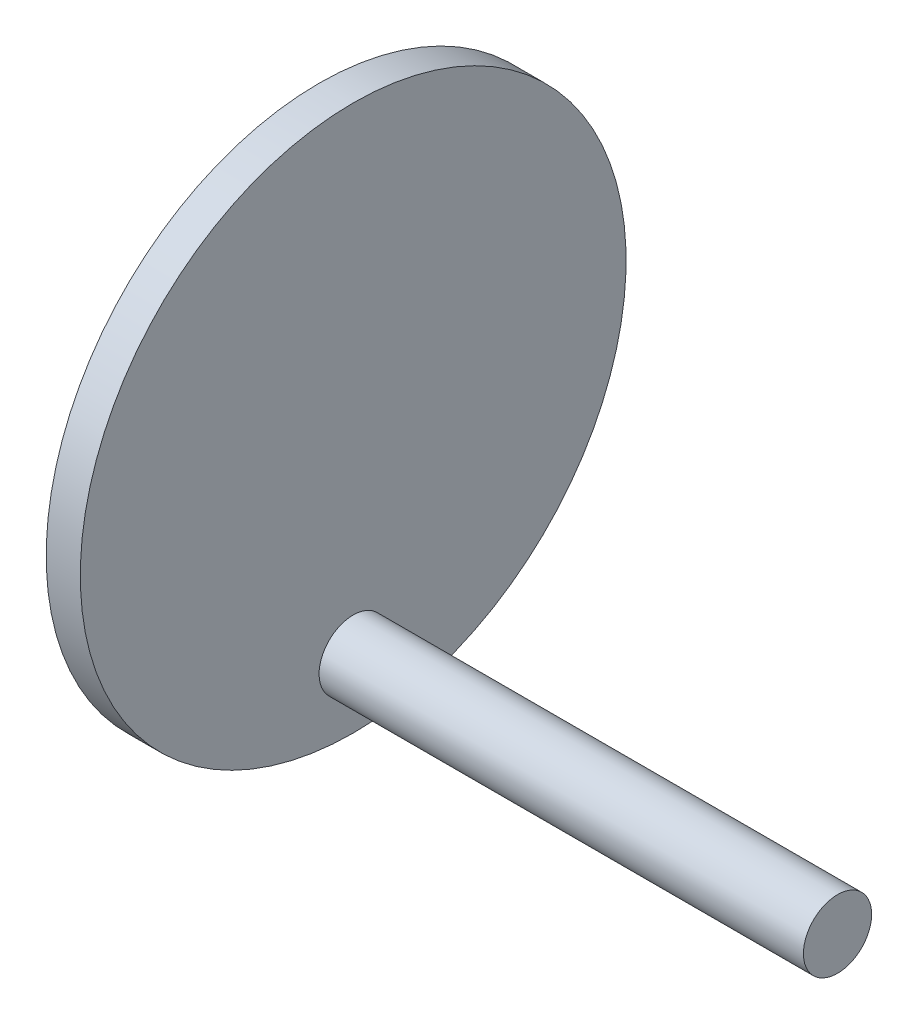
ISO-10303-21;
HEADER;
FILE_DESCRIPTION(('STEP AP214'),'2;1');
FILE_NAME('part.step','',(''),(''),'','','');
FILE_SCHEMA(('AUTOMOTIVE_DESIGN { 1 0 10303 214 1 1 1 1 }'));
ENDSEC;
DATA;
#1=APPLICATION_CONTEXT('core data for automotive mechanical design processes');
#2=APPLICATION_PROTOCOL_DEFINITION('international standard','automotive_design',2000,#1);
#3=PRODUCT_CONTEXT('',#1,'mechanical');
#4=PRODUCT('Part','Part','',(#3));
#5=PRODUCT_RELATED_PRODUCT_CATEGORY('part','',(#4));
#6=PRODUCT_DEFINITION_FORMATION('','',#4);
#7=PRODUCT_DEFINITION_CONTEXT('part definition',#1,'design');
#8=PRODUCT_DEFINITION('design','',#6,#7);
#9=PRODUCT_DEFINITION_SHAPE('','',#8);
#10=(LENGTH_UNIT() NAMED_UNIT(*) SI_UNIT(.MILLI.,.METRE.));
#11=(NAMED_UNIT(*) PLANE_ANGLE_UNIT() SI_UNIT($,.RADIAN.));
#12=(NAMED_UNIT(*) SI_UNIT($,.STERADIAN.) SOLID_ANGLE_UNIT());
#13=UNCERTAINTY_MEASURE_WITH_UNIT(LENGTH_MEASURE(1.E-05),#10,'distance_accuracy_value','');
#14=(GEOMETRIC_REPRESENTATION_CONTEXT(3) GLOBAL_UNCERTAINTY_ASSIGNED_CONTEXT((#13)) GLOBAL_UNIT_ASSIGNED_CONTEXT((#10,
#11,#12)) REPRESENTATION_CONTEXT('',''));
#15=CARTESIAN_POINT('',(0.,0.,0.));
#16=DIRECTION('',(0.,0.,1.));
#17=DIRECTION('',(1.,0.,0.));
#18=AXIS2_PLACEMENT_3D('',#15,#16,#17);
#19=CARTESIAN_POINT('',(-4.99999999999999,60.,0.));
#20=DIRECTION('',(1.,0.,0.));
#21=DIRECTION('',(0.,1.,0.));
#22=AXIS2_PLACEMENT_3D('',#19,#20,#21);
#23=CYLINDRICAL_SURFACE('',#22,7.5);
#24=CARTESIAN_POINT('',(-4.99999999999999,60.,0.));
#25=DIRECTION('',(1.,0.,0.));
#26=DIRECTION('',(0.,1.,0.));
#27=AXIS2_PLACEMENT_3D('',#24,#25,#26);
#28=CIRCLE('',#27,7.5);
#29=CARTESIAN_POINT('',(-4.99999999999999,67.5,0.));
#30=VERTEX_POINT('',#29);
#31=EDGE_CURVE('E10',#30,#30,#28,.T.);
#32=ORIENTED_EDGE('',*,*,#31,.T.);
#33=EDGE_LOOP('',(#32));
#34=FACE_BOUND('',#33,.T.);
#35=CARTESIAN_POINT('',(15.,60.,0.));
#36=DIRECTION('',(1.,0.,0.));
#37=DIRECTION('',(0.,1.,0.));
#38=AXIS2_PLACEMENT_3D('',#35,#36,#37);
#39=CIRCLE('',#38,7.5);
#40=CARTESIAN_POINT('',(15.,67.5,0.));
#41=VERTEX_POINT('',#40);
#42=EDGE_CURVE('E41',#41,#41,#39,.T.);
#43=ORIENTED_EDGE('',*,*,#42,.F.);
#44=EDGE_LOOP('',(#43));
#45=FACE_BOUND('',#44,.T.);
#46=ADVANCED_FACE('F35',(#34,#45),#23,.T.);
#47=CARTESIAN_POINT('',(-4.99999999999999,60.,0.));
#48=DIRECTION('',(1.,0.,0.));
#49=DIRECTION('',(0.,1.,0.));
#50=AXIS2_PLACEMENT_3D('',#47,#48,#49);
#51=PLANE('',#50);
#52=ORIENTED_EDGE('',*,*,#31,.F.);
#53=EDGE_LOOP('',(#52));
#54=FACE_BOUND('',#53,.T.);
#55=ADVANCED_FACE('F79',(#54),#51,.F.);
#56=CARTESIAN_POINT('',(20.,60.,0.));
#57=DIRECTION('',(-1.,0.,0.));
#58=DIRECTION('',(0.,-1.,0.));
#59=AXIS2_PLACEMENT_3D('',#56,#57,#58);
#60=CYLINDRICAL_SURFACE('',#59,40.);
#61=CARTESIAN_POINT('',(20.,60.,0.));
#62=DIRECTION('',(1.,0.,0.));
#63=DIRECTION('',(0.,1.,0.));
#64=AXIS2_PLACEMENT_3D('',#61,#62,#63);
#65=CIRCLE('',#64,40.);
#66=CARTESIAN_POINT('',(20.,100.,0.));
#67=VERTEX_POINT('',#66);
#68=EDGE_CURVE('E45',#67,#67,#65,.T.);
#69=ORIENTED_EDGE('',*,*,#68,.F.);
#70=EDGE_LOOP('',(#69));
#71=FACE_BOUND('',#70,.T.);
#72=CARTESIAN_POINT('',(15.,60.,0.));
#73=DIRECTION('',(1.,0.,0.));
#74=DIRECTION('',(0.,1.,0.));
#75=AXIS2_PLACEMENT_3D('',#72,#73,#74);
#76=CIRCLE('',#75,40.);
#77=CARTESIAN_POINT('',(15.,100.,0.));
#78=VERTEX_POINT('',#77);
#79=EDGE_CURVE('E49',#78,#78,#76,.T.);
#80=ORIENTED_EDGE('',*,*,#79,.T.);
#81=EDGE_LOOP('',(#80));
#82=FACE_BOUND('',#81,.T.);
#83=ADVANCED_FACE('F73',(#71,#82),#60,.T.);
#84=CARTESIAN_POINT('',(20.,60.,0.));
#85=DIRECTION('',(1.,0.,0.));
#86=DIRECTION('',(0.,1.,0.));
#87=AXIS2_PLACEMENT_3D('',#84,#85,#86);
#88=PLANE('',#87);
#89=CARTESIAN_POINT('',(20.,30.,0.));
#90=DIRECTION('',(1.,0.,0.));
#91=DIRECTION('',(0.,1.,0.));
#92=AXIS2_PLACEMENT_3D('',#89,#90,#91);
#93=CIRCLE('',#92,5.);
#94=CARTESIAN_POINT('',(20.,35.,0.));
#95=VERTEX_POINT('',#94);
#96=EDGE_CURVE('E55',#95,#95,#93,.T.);
#97=ORIENTED_EDGE('',*,*,#96,.F.);
#98=EDGE_LOOP('',(#97));
#99=FACE_BOUND('',#98,.T.);
#100=ORIENTED_EDGE('',*,*,#68,.T.);
#101=EDGE_LOOP('',(#100));
#102=FACE_BOUND('',#101,.T.);
#103=ADVANCED_FACE('F70',(#99,#102),#88,.T.);
#104=CARTESIAN_POINT('',(15.,60.,0.));
#105=DIRECTION('',(1.,0.,0.));
#106=DIRECTION('',(0.,1.,0.));
#107=AXIS2_PLACEMENT_3D('',#104,#105,#106);
#108=PLANE('',#107);
#109=ORIENTED_EDGE('',*,*,#42,.T.);
#110=EDGE_LOOP('',(#109));
#111=FACE_BOUND('',#110,.T.);
#112=ORIENTED_EDGE('',*,*,#79,.F.);
#113=EDGE_LOOP('',(#112));
#114=FACE_BOUND('',#113,.T.);
#115=ADVANCED_FACE('F66',(#111,#114),#108,.F.);
#116=CARTESIAN_POINT('',(90.9880551903902,30.,0.));
#117=DIRECTION('',(-1.,0.,0.));
#118=DIRECTION('',(0.,-1.,0.));
#119=AXIS2_PLACEMENT_3D('',#116,#117,#118);
#120=CYLINDRICAL_SURFACE('',#119,5.);
#121=CARTESIAN_POINT('',(90.9880551903902,30.,0.));
#122=DIRECTION('',(1.,0.,0.));
#123=DIRECTION('',(0.,1.,0.));
#124=AXIS2_PLACEMENT_3D('',#121,#122,#123);
#125=CIRCLE('',#124,5.);
#126=CARTESIAN_POINT('',(90.9880551903902,35.,0.));
#127=VERTEX_POINT('',#126);
#128=EDGE_CURVE('E53',#127,#127,#125,.T.);
#129=ORIENTED_EDGE('',*,*,#128,.F.);
#130=EDGE_LOOP('',(#129));
#131=FACE_BOUND('',#130,.T.);
#132=ORIENTED_EDGE('',*,*,#96,.T.);
#133=EDGE_LOOP('',(#132));
#134=FACE_BOUND('',#133,.T.);
#135=ADVANCED_FACE('F63',(#131,#134),#120,.T.);
#136=CARTESIAN_POINT('',(90.9880551903902,30.,0.));
#137=DIRECTION('',(1.,0.,0.));
#138=DIRECTION('',(0.,1.,0.));
#139=AXIS2_PLACEMENT_3D('',#136,#137,#138);
#140=PLANE('',#139);
#141=ORIENTED_EDGE('',*,*,#128,.T.);
#142=EDGE_LOOP('',(#141));
#143=FACE_BOUND('',#142,.T.);
#144=ADVANCED_FACE('F61',(#143),#140,.T.);
#145=CLOSED_SHELL('',(#46,#55,#83,#103,#115,#135,#144));
#146=MANIFOLD_SOLID_BREP('B2',#145);
#147=ADVANCED_BREP_SHAPE_REPRESENTATION('',(#18,#146),#14);
#148=SHAPE_DEFINITION_REPRESENTATION(#9,#147);
ENDSEC;
END-ISO-10303-21;
